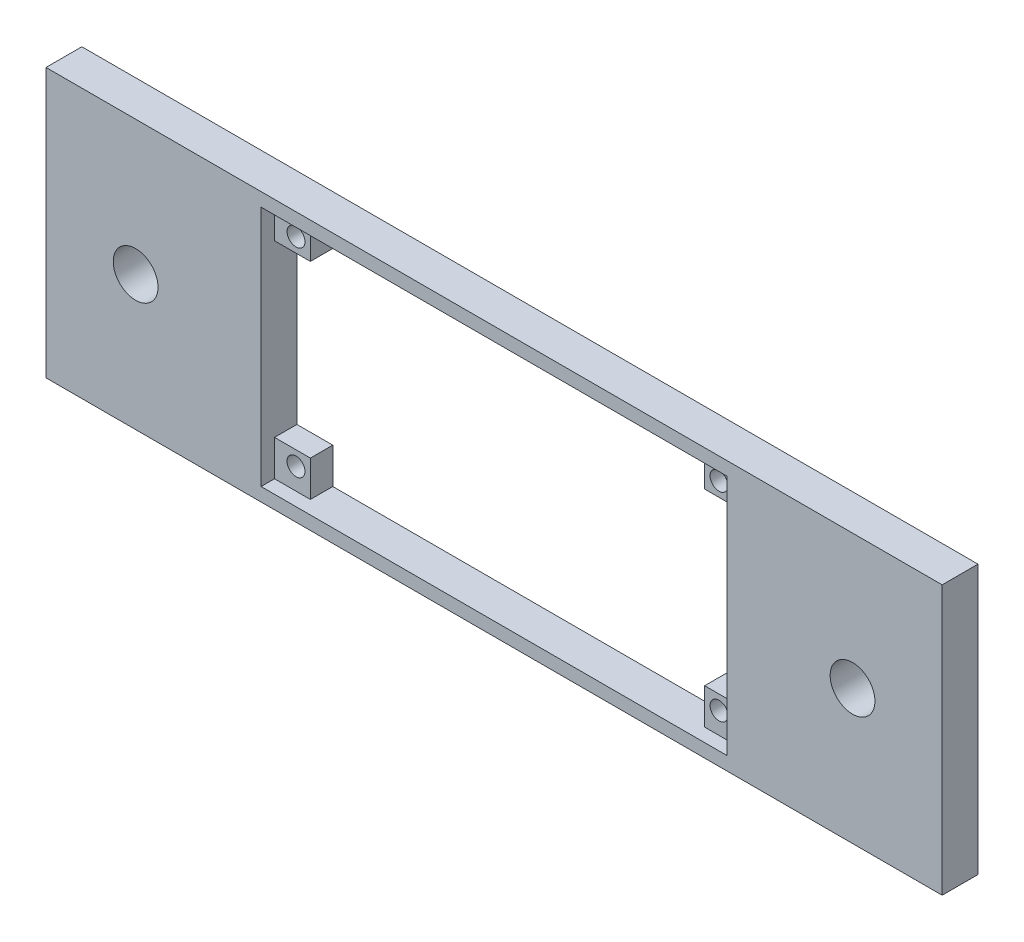
ISO-10303-21;
HEADER;
FILE_DESCRIPTION(('STEP AP214'),'2;1');
FILE_NAME('part.step','',(''),(''),'','','');
FILE_SCHEMA(('AUTOMOTIVE_DESIGN { 1 0 10303 214 1 1 1 1 }'));
ENDSEC;
DATA;
#1=APPLICATION_CONTEXT('core data for automotive mechanical design processes');
#2=APPLICATION_PROTOCOL_DEFINITION('international standard','automotive_design',2000,#1);
#3=PRODUCT_CONTEXT('',#1,'mechanical');
#4=PRODUCT('Part','Part','',(#3));
#5=PRODUCT_RELATED_PRODUCT_CATEGORY('part','',(#4));
#6=PRODUCT_DEFINITION_FORMATION('','',#4);
#7=PRODUCT_DEFINITION_CONTEXT('part definition',#1,'design');
#8=PRODUCT_DEFINITION('design','',#6,#7);
#9=PRODUCT_DEFINITION_SHAPE('','',#8);
#10=(LENGTH_UNIT() NAMED_UNIT(*) SI_UNIT(.MILLI.,.METRE.));
#11=(NAMED_UNIT(*) PLANE_ANGLE_UNIT() SI_UNIT($,.RADIAN.));
#12=(NAMED_UNIT(*) SI_UNIT($,.STERADIAN.) SOLID_ANGLE_UNIT());
#13=UNCERTAINTY_MEASURE_WITH_UNIT(LENGTH_MEASURE(1.E-05),#10,'distance_accuracy_value','');
#14=(GEOMETRIC_REPRESENTATION_CONTEXT(3) GLOBAL_UNCERTAINTY_ASSIGNED_CONTEXT((#13)) GLOBAL_UNIT_ASSIGNED_CONTEXT((#10,
#11,#12)) REPRESENTATION_CONTEXT('',''));
#15=CARTESIAN_POINT('',(0.,0.,0.));
#16=DIRECTION('',(0.,0.,1.));
#17=DIRECTION('',(1.,0.,0.));
#18=AXIS2_PLACEMENT_3D('',#15,#16,#17);
#19=CARTESIAN_POINT('',(-26.,13.5,4.));
#20=DIRECTION('',(0.,-1.,0.));
#21=DIRECTION('',(1.,0.,0.));
#22=AXIS2_PLACEMENT_3D('',#19,#20,#21);
#23=PLANE('',#22);
#24=DIRECTION('',(0.,0.,-1.));
#25=VECTOR('',#24,1.);
#26=CARTESIAN_POINT('',(-26.,13.5,4.));
#27=LINE('',#26,#25);
#28=CARTESIAN_POINT('',(-26.,13.5,4.));
#29=VERTEX_POINT('',#28);
#30=CARTESIAN_POINT('',(-26.,13.5,2.5));
#31=VERTEX_POINT('',#30);
#32=EDGE_CURVE('E190',#29,#31,#27,.T.);
#33=ORIENTED_EDGE('',*,*,#32,.T.);
#34=DIRECTION('',(-1.,0.,0.));
#35=VECTOR('',#34,1.);
#36=CARTESIAN_POINT('',(-26.,13.5,2.5));
#37=LINE('',#36,#35);
#38=CARTESIAN_POINT('',(-22.,13.5,2.5));
#39=VERTEX_POINT('',#38);
#40=EDGE_CURVE('E172',#39,#31,#37,.T.);
#41=ORIENTED_EDGE('',*,*,#40,.F.);
#42=DIRECTION('',(0.,0.,-1.));
#43=VECTOR('',#42,1.);
#44=CARTESIAN_POINT('',(-22.,13.5,2.5));
#45=LINE('',#44,#43);
#46=CARTESIAN_POINT('',(-22.,13.5,0.));
#47=VERTEX_POINT('',#46);
#48=EDGE_CURVE('E370',#39,#47,#45,.T.);
#49=ORIENTED_EDGE('',*,*,#48,.T.);
#50=DIRECTION('',(-1.,0.,0.));
#51=VECTOR('',#50,1.);
#52=CARTESIAN_POINT('',(-26.,13.5,0.));
#53=LINE('',#52,#51);
#54=CARTESIAN_POINT('',(22.,13.5,0.));
#55=VERTEX_POINT('',#54);
#56=EDGE_CURVE('E484',#55,#47,#53,.T.);
#57=ORIENTED_EDGE('',*,*,#56,.F.);
#58=DIRECTION('',(0.,0.,-1.));
#59=VECTOR('',#58,1.);
#60=CARTESIAN_POINT('',(22.,13.5,2.5));
#61=LINE('',#60,#59);
#62=CARTESIAN_POINT('',(22.,13.5,2.5));
#63=VERTEX_POINT('',#62);
#64=EDGE_CURVE('E460',#63,#55,#61,.T.);
#65=ORIENTED_EDGE('',*,*,#64,.F.);
#66=DIRECTION('',(-1.,0.,0.));
#67=VECTOR('',#66,1.);
#68=CARTESIAN_POINT('',(26.,13.5,2.5));
#69=LINE('',#68,#67);
#70=CARTESIAN_POINT('',(26.,13.5,2.5));
#71=VERTEX_POINT('',#70);
#72=EDGE_CURVE('E443',#71,#63,#69,.T.);
#73=ORIENTED_EDGE('',*,*,#72,.F.);
#74=DIRECTION('',(0.,0.,-1.));
#75=VECTOR('',#74,1.);
#76=CARTESIAN_POINT('',(26.,13.5,4.));
#77=LINE('',#76,#75);
#78=CARTESIAN_POINT('',(26.,13.5,4.));
#79=VERTEX_POINT('',#78);
#80=EDGE_CURVE('E198',#79,#71,#77,.T.);
#81=ORIENTED_EDGE('',*,*,#80,.F.);
#82=DIRECTION('',(-1.,0.,0.));
#83=VECTOR('',#82,1.);
#84=CARTESIAN_POINT('',(-26.,13.5,4.));
#85=LINE('',#84,#83);
#86=EDGE_CURVE('E197',#79,#29,#85,.T.);
#87=ORIENTED_EDGE('',*,*,#86,.T.);
#88=EDGE_LOOP('',(#33,#41,#49,#57,#65,#73,#81,#87));
#89=FACE_BOUND('',#88,.T.);
#90=ADVANCED_FACE('F36',(#89),#23,.T.);
#91=CARTESIAN_POINT('',(-26.,-13.5,4.));
#92=DIRECTION('',(1.,0.,0.));
#93=DIRECTION('',(0.,0.,-1.));
#94=AXIS2_PLACEMENT_3D('',#91,#92,#93);
#95=PLANE('',#94);
#96=DIRECTION('',(0.,0.,-1.));
#97=VECTOR('',#96,1.);
#98=CARTESIAN_POINT('',(-26.,9.5,2.5));
#99=LINE('',#98,#97);
#100=CARTESIAN_POINT('',(-26.,9.5,2.5));
#101=VERTEX_POINT('',#100);
#102=CARTESIAN_POINT('',(-26.,9.5,0.));
#103=VERTEX_POINT('',#102);
#104=EDGE_CURVE('E193',#101,#103,#99,.T.);
#105=ORIENTED_EDGE('',*,*,#104,.F.);
#106=DIRECTION('',(0.,-1.,0.));
#107=VECTOR('',#106,1.);
#108=CARTESIAN_POINT('',(-26.,13.5,2.5));
#109=LINE('',#108,#107);
#110=EDGE_CURVE('E176',#31,#101,#109,.T.);
#111=ORIENTED_EDGE('',*,*,#110,.F.);
#112=ORIENTED_EDGE('',*,*,#32,.F.);
#113=DIRECTION('',(0.,-1.,0.));
#114=VECTOR('',#113,1.);
#115=CARTESIAN_POINT('',(-26.,-13.5,4.));
#116=LINE('',#115,#114);
#117=CARTESIAN_POINT('',(-26.,-13.5,4.));
#118=VERTEX_POINT('',#117);
#119=EDGE_CURVE('E479',#29,#118,#116,.T.);
#120=ORIENTED_EDGE('',*,*,#119,.T.);
#121=DIRECTION('',(0.,0.,-1.));
#122=VECTOR('',#121,1.);
#123=CARTESIAN_POINT('',(-26.,-13.5,4.));
#124=LINE('',#123,#122);
#125=CARTESIAN_POINT('',(-26.,-13.5,2.5));
#126=VERTEX_POINT('',#125);
#127=EDGE_CURVE('E199',#118,#126,#124,.T.);
#128=ORIENTED_EDGE('',*,*,#127,.T.);
#129=DIRECTION('',(0.,-1.,0.));
#130=VECTOR('',#129,1.);
#131=CARTESIAN_POINT('',(-26.,-13.5,2.5));
#132=LINE('',#131,#130);
#133=CARTESIAN_POINT('',(-26.,-9.5,2.5));
#134=VERTEX_POINT('',#133);
#135=EDGE_CURVE('E391',#134,#126,#132,.T.);
#136=ORIENTED_EDGE('',*,*,#135,.F.);
#137=DIRECTION('',(0.,0.,-1.));
#138=VECTOR('',#137,1.);
#139=CARTESIAN_POINT('',(-26.,-9.5,2.5));
#140=LINE('',#139,#138);
#141=CARTESIAN_POINT('',(-26.,-9.5,0.));
#142=VERTEX_POINT('',#141);
#143=EDGE_CURVE('E393',#134,#142,#140,.T.);
#144=ORIENTED_EDGE('',*,*,#143,.T.);
#145=DIRECTION('',(0.,-1.,0.));
#146=VECTOR('',#145,1.);
#147=CARTESIAN_POINT('',(-26.,-13.5,0.));
#148=LINE('',#147,#146);
#149=EDGE_CURVE('E487',#103,#142,#148,.T.);
#150=ORIENTED_EDGE('',*,*,#149,.F.);
#151=EDGE_LOOP('',(#105,#111,#112,#120,#128,#136,#144,#150));
#152=FACE_BOUND('',#151,.T.);
#153=ADVANCED_FACE('F188',(#152),#95,.T.);
#154=CARTESIAN_POINT('',(26.,-13.5,4.));
#155=DIRECTION('',(-1.,0.,0.));
#156=DIRECTION('',(0.,-1.,0.));
#157=AXIS2_PLACEMENT_3D('',#154,#155,#156);
#158=PLANE('',#157);
#159=DIRECTION('',(0.,1.,0.));
#160=VECTOR('',#159,1.);
#161=CARTESIAN_POINT('',(26.,-13.5,2.5));
#162=LINE('',#161,#160);
#163=CARTESIAN_POINT('',(26.,-13.5,2.5));
#164=VERTEX_POINT('',#163);
#165=CARTESIAN_POINT('',(26.,-9.5,2.5));
#166=VERTEX_POINT('',#165);
#167=EDGE_CURVE('E412',#164,#166,#162,.T.);
#168=ORIENTED_EDGE('',*,*,#167,.F.);
#169=DIRECTION('',(0.,0.,-1.));
#170=VECTOR('',#169,1.);
#171=CARTESIAN_POINT('',(26.,-13.5,4.));
#172=LINE('',#171,#170);
#173=CARTESIAN_POINT('',(26.,-13.5,4.));
#174=VERTEX_POINT('',#173);
#175=EDGE_CURVE('E205',#174,#164,#172,.T.);
#176=ORIENTED_EDGE('',*,*,#175,.F.);
#177=DIRECTION('',(0.,1.,0.));
#178=VECTOR('',#177,1.);
#179=CARTESIAN_POINT('',(26.,-13.5,4.));
#180=LINE('',#179,#178);
#181=EDGE_CURVE('E475',#174,#79,#180,.T.);
#182=ORIENTED_EDGE('',*,*,#181,.T.);
#183=ORIENTED_EDGE('',*,*,#80,.T.);
#184=DIRECTION('',(0.,1.,0.));
#185=VECTOR('',#184,1.);
#186=CARTESIAN_POINT('',(26.,13.5,2.5));
#187=LINE('',#186,#185);
#188=CARTESIAN_POINT('',(26.,9.5,2.5));
#189=VERTEX_POINT('',#188);
#190=EDGE_CURVE('E441',#189,#71,#187,.T.);
#191=ORIENTED_EDGE('',*,*,#190,.F.);
#192=DIRECTION('',(0.,0.,-1.));
#193=VECTOR('',#192,1.);
#194=CARTESIAN_POINT('',(26.,9.5,2.5));
#195=LINE('',#194,#193);
#196=CARTESIAN_POINT('',(26.,9.5,0.));
#197=VERTEX_POINT('',#196);
#198=EDGE_CURVE('E451',#189,#197,#195,.T.);
#199=ORIENTED_EDGE('',*,*,#198,.T.);
#200=DIRECTION('',(0.,1.,0.));
#201=VECTOR('',#200,1.);
#202=CARTESIAN_POINT('',(26.,-13.5,0.));
#203=LINE('',#202,#201);
#204=CARTESIAN_POINT('',(26.,-9.5,0.));
#205=VERTEX_POINT('',#204);
#206=EDGE_CURVE('E472',#205,#197,#203,.T.);
#207=ORIENTED_EDGE('',*,*,#206,.F.);
#208=DIRECTION('',(0.,0.,-1.));
#209=VECTOR('',#208,1.);
#210=CARTESIAN_POINT('',(26.,-9.5,2.5));
#211=LINE('',#210,#209);
#212=EDGE_CURVE('E431',#166,#205,#211,.T.);
#213=ORIENTED_EDGE('',*,*,#212,.F.);
#214=EDGE_LOOP('',(#168,#176,#182,#183,#191,#199,#207,#213));
#215=FACE_BOUND('',#214,.T.);
#216=ADVANCED_FACE('F266',(#215),#158,.T.);
#217=CARTESIAN_POINT('',(0.,0.,4.));
#218=DIRECTION('',(0.,0.,-1.));
#219=DIRECTION('',(-1.,0.,0.));
#220=AXIS2_PLACEMENT_3D('',#217,#218,#219);
#221=PLANE('',#220);
#222=DIRECTION('',(0.,1.,0.));
#223=VECTOR('',#222,1.);
#224=CARTESIAN_POINT('',(50.,-15.,4.));
#225=LINE('',#224,#223);
#226=CARTESIAN_POINT('',(50.,-15.,4.));
#227=VERTEX_POINT('',#226);
#228=CARTESIAN_POINT('',(50.,15.,4.));
#229=VERTEX_POINT('',#228);
#230=EDGE_CURVE('E209',#227,#229,#225,.T.);
#231=ORIENTED_EDGE('',*,*,#230,.T.);
#232=DIRECTION('',(-1.,0.,0.));
#233=VECTOR('',#232,1.);
#234=CARTESIAN_POINT('',(-50.,15.,4.));
#235=LINE('',#234,#233);
#236=CARTESIAN_POINT('',(-50.,15.,4.));
#237=VERTEX_POINT('',#236);
#238=EDGE_CURVE('E212',#229,#237,#235,.T.);
#239=ORIENTED_EDGE('',*,*,#238,.T.);
#240=DIRECTION('',(0.,-1.,0.));
#241=VECTOR('',#240,1.);
#242=CARTESIAN_POINT('',(-50.,-15.,4.));
#243=LINE('',#242,#241);
#244=CARTESIAN_POINT('',(-50.,-15.,4.));
#245=VERTEX_POINT('',#244);
#246=EDGE_CURVE('E215',#237,#245,#243,.T.);
#247=ORIENTED_EDGE('',*,*,#246,.T.);
#248=DIRECTION('',(1.,0.,0.));
#249=VECTOR('',#248,1.);
#250=CARTESIAN_POINT('',(-50.,-15.,4.));
#251=LINE('',#250,#249);
#252=EDGE_CURVE('E217',#245,#227,#251,.T.);
#253=ORIENTED_EDGE('',*,*,#252,.T.);
#254=EDGE_LOOP('',(#231,#239,#247,#253));
#255=FACE_BOUND('',#254,.T.);
#256=ORIENTED_EDGE('',*,*,#181,.F.);
#257=DIRECTION('',(1.,0.,0.));
#258=VECTOR('',#257,1.);
#259=CARTESIAN_POINT('',(-26.,-13.5,4.));
#260=LINE('',#259,#258);
#261=EDGE_CURVE('E481',#118,#174,#260,.T.);
#262=ORIENTED_EDGE('',*,*,#261,.F.);
#263=ORIENTED_EDGE('',*,*,#119,.F.);
#264=ORIENTED_EDGE('',*,*,#86,.F.);
#265=EDGE_LOOP('',(#256,#262,#263,#264));
#266=FACE_BOUND('',#265,.T.);
#267=CARTESIAN_POINT('',(-40.,0.,4.));
#268=DIRECTION('',(0.,0.,1.));
#269=DIRECTION('',(1.,0.,0.));
#270=AXIS2_PLACEMENT_3D('',#267,#268,#269);
#271=CIRCLE('',#270,2.5);
#272=CARTESIAN_POINT('',(-37.5,0.,4.));
#273=VERTEX_POINT('',#272);
#274=EDGE_CURVE('E469',#273,#273,#271,.T.);
#275=ORIENTED_EDGE('',*,*,#274,.F.);
#276=EDGE_LOOP('',(#275));
#277=FACE_BOUND('',#276,.T.);
#278=CARTESIAN_POINT('',(40.,0.,4.));
#279=DIRECTION('',(0.,0.,1.));
#280=DIRECTION('',(-1.,0.,0.));
#281=AXIS2_PLACEMENT_3D('',#278,#279,#280);
#282=CIRCLE('',#281,2.5);
#283=CARTESIAN_POINT('',(37.5,0.,4.));
#284=VERTEX_POINT('',#283);
#285=EDGE_CURVE('E463',#284,#284,#282,.T.);
#286=ORIENTED_EDGE('',*,*,#285,.F.);
#287=EDGE_LOOP('',(#286));
#288=FACE_BOUND('',#287,.T.);
#289=ADVANCED_FACE('F252',(#255,#266,#277,#288),#221,.F.);
#290=CARTESIAN_POINT('',(0.,0.,0.));
#291=DIRECTION('',(0.,0.,-1.));
#292=DIRECTION('',(-1.,0.,0.));
#293=AXIS2_PLACEMENT_3D('',#290,#291,#292);
#294=PLANE('',#293);
#295=DIRECTION('',(-1.,0.,0.));
#296=VECTOR('',#295,1.);
#297=CARTESIAN_POINT('',(26.,-9.5,0.));
#298=LINE('',#297,#296);
#299=CARTESIAN_POINT('',(22.,-9.5,0.));
#300=VERTEX_POINT('',#299);
#301=EDGE_CURVE('E409',#205,#300,#298,.T.);
#302=ORIENTED_EDGE('',*,*,#301,.F.);
#303=ORIENTED_EDGE('',*,*,#206,.T.);
#304=DIRECTION('',(1.,0.,0.));
#305=VECTOR('',#304,1.);
#306=CARTESIAN_POINT('',(26.,9.5,0.));
#307=LINE('',#306,#305);
#308=CARTESIAN_POINT('',(22.,9.5,0.));
#309=VERTEX_POINT('',#308);
#310=EDGE_CURVE('E444',#309,#197,#307,.T.);
#311=ORIENTED_EDGE('',*,*,#310,.F.);
#312=DIRECTION('',(0.,-1.,0.));
#313=VECTOR('',#312,1.);
#314=CARTESIAN_POINT('',(22.,13.5,0.));
#315=LINE('',#314,#313);
#316=EDGE_CURVE('E438',#55,#309,#315,.T.);
#317=ORIENTED_EDGE('',*,*,#316,.F.);
#318=ORIENTED_EDGE('',*,*,#56,.T.);
#319=DIRECTION('',(0.,1.,0.));
#320=VECTOR('',#319,1.);
#321=CARTESIAN_POINT('',(-22.,13.5,0.));
#322=LINE('',#321,#320);
#323=CARTESIAN_POINT('',(-22.,9.50000000000001,0.));
#324=VERTEX_POINT('',#323);
#325=EDGE_CURVE('E184',#324,#47,#322,.T.);
#326=ORIENTED_EDGE('',*,*,#325,.F.);
#327=DIRECTION('',(1.,0.,0.));
#328=VECTOR('',#327,1.);
#329=CARTESIAN_POINT('',(-26.,9.5,0.));
#330=LINE('',#329,#328);
#331=EDGE_CURVE('E365',#103,#324,#330,.T.);
#332=ORIENTED_EDGE('',*,*,#331,.F.);
#333=ORIENTED_EDGE('',*,*,#149,.T.);
#334=DIRECTION('',(-1.,0.,0.));
#335=VECTOR('',#334,1.);
#336=CARTESIAN_POINT('',(-26.,-9.5,0.));
#337=LINE('',#336,#335);
#338=CARTESIAN_POINT('',(-22.,-9.50000000000001,0.));
#339=VERTEX_POINT('',#338);
#340=EDGE_CURVE('E387',#339,#142,#337,.T.);
#341=ORIENTED_EDGE('',*,*,#340,.F.);
#342=DIRECTION('',(0.,1.,0.));
#343=VECTOR('',#342,1.);
#344=CARTESIAN_POINT('',(-22.,-13.5,0.));
#345=LINE('',#344,#343);
#346=CARTESIAN_POINT('',(-22.,-13.5,0.));
#347=VERTEX_POINT('',#346);
#348=EDGE_CURVE('E382',#347,#339,#345,.T.);
#349=ORIENTED_EDGE('',*,*,#348,.F.);
#350=DIRECTION('',(1.,0.,0.));
#351=VECTOR('',#350,1.);
#352=CARTESIAN_POINT('',(-26.,-13.5,0.));
#353=LINE('',#352,#351);
#354=CARTESIAN_POINT('',(22.,-13.5,0.));
#355=VERTEX_POINT('',#354);
#356=EDGE_CURVE('E477',#347,#355,#353,.T.);
#357=ORIENTED_EDGE('',*,*,#356,.T.);
#358=DIRECTION('',(0.,-1.,0.));
#359=VECTOR('',#358,1.);
#360=CARTESIAN_POINT('',(22.,-13.5,0.));
#361=LINE('',#360,#359);
#362=EDGE_CURVE('E416',#300,#355,#361,.T.);
#363=ORIENTED_EDGE('',*,*,#362,.F.);
#364=EDGE_LOOP('',(#302,#303,#311,#317,#318,#326,#332,#333,#341,#349,#357,#363));
#365=FACE_BOUND('',#364,.T.);
#366=CARTESIAN_POINT('',(-40.,0.,0.));
#367=DIRECTION('',(0.,0.,1.));
#368=DIRECTION('',(1.,0.,0.));
#369=AXIS2_PLACEMENT_3D('',#366,#367,#368);
#370=CIRCLE('',#369,2.5);
#371=CARTESIAN_POINT('',(-37.5,0.,0.));
#372=VERTEX_POINT('',#371);
#373=EDGE_CURVE('E466',#372,#372,#370,.T.);
#374=ORIENTED_EDGE('',*,*,#373,.T.);
#375=EDGE_LOOP('',(#374));
#376=FACE_BOUND('',#375,.T.);
#377=DIRECTION('',(0.,1.,0.));
#378=VECTOR('',#377,1.);
#379=CARTESIAN_POINT('',(50.,-15.,0.));
#380=LINE('',#379,#378);
#381=CARTESIAN_POINT('',(50.,-15.,0.));
#382=VERTEX_POINT('',#381);
#383=CARTESIAN_POINT('',(50.,15.,0.));
#384=VERTEX_POINT('',#383);
#385=EDGE_CURVE('E202',#382,#384,#380,.T.);
#386=ORIENTED_EDGE('',*,*,#385,.F.);
#387=DIRECTION('',(1.,0.,0.));
#388=VECTOR('',#387,1.);
#389=CARTESIAN_POINT('',(-50.,-15.,0.));
#390=LINE('',#389,#388);
#391=CARTESIAN_POINT('',(-50.,-15.,0.));
#392=VERTEX_POINT('',#391);
#393=EDGE_CURVE('E213',#392,#382,#390,.T.);
#394=ORIENTED_EDGE('',*,*,#393,.F.);
#395=DIRECTION('',(0.,-1.,0.));
#396=VECTOR('',#395,1.);
#397=CARTESIAN_POINT('',(-50.,-15.,0.));
#398=LINE('',#397,#396);
#399=CARTESIAN_POINT('',(-50.,15.,0.));
#400=VERTEX_POINT('',#399);
#401=EDGE_CURVE('E224',#400,#392,#398,.T.);
#402=ORIENTED_EDGE('',*,*,#401,.F.);
#403=DIRECTION('',(-1.,0.,0.));
#404=VECTOR('',#403,1.);
#405=CARTESIAN_POINT('',(-50.,15.,0.));
#406=LINE('',#405,#404);
#407=EDGE_CURVE('E222',#384,#400,#406,.T.);
#408=ORIENTED_EDGE('',*,*,#407,.F.);
#409=EDGE_LOOP('',(#386,#394,#402,#408));
#410=FACE_BOUND('',#409,.T.);
#411=CARTESIAN_POINT('',(40.,0.,0.));
#412=DIRECTION('',(0.,0.,1.));
#413=DIRECTION('',(-1.,0.,0.));
#414=AXIS2_PLACEMENT_3D('',#411,#412,#413);
#415=CIRCLE('',#414,2.5);
#416=CARTESIAN_POINT('',(37.5,0.,0.));
#417=VERTEX_POINT('',#416);
#418=EDGE_CURVE('E462',#417,#417,#415,.T.);
#419=ORIENTED_EDGE('',*,*,#418,.T.);
#420=EDGE_LOOP('',(#419));
#421=FACE_BOUND('',#420,.T.);
#422=CARTESIAN_POINT('',(23.6,11.1,0.));
#423=DIRECTION('',(0.,0.,1.));
#424=DIRECTION('',(1.,0.,0.));
#425=AXIS2_PLACEMENT_3D('',#422,#423,#424);
#426=CIRCLE('',#425,1.);
#427=CARTESIAN_POINT('',(24.6,11.1,0.));
#428=VERTEX_POINT('',#427);
#429=EDGE_CURVE('E434',#428,#428,#426,.T.);
#430=ORIENTED_EDGE('',*,*,#429,.T.);
#431=EDGE_LOOP('',(#430));
#432=FACE_BOUND('',#431,.T.);
#433=CARTESIAN_POINT('',(23.6,-11.1,0.));
#434=DIRECTION('',(0.,0.,1.));
#435=DIRECTION('',(-1.,0.,0.));
#436=AXIS2_PLACEMENT_3D('',#433,#434,#435);
#437=CIRCLE('',#436,1.);
#438=CARTESIAN_POINT('',(22.6,-11.1,0.));
#439=VERTEX_POINT('',#438);
#440=EDGE_CURVE('E405',#439,#439,#437,.T.);
#441=ORIENTED_EDGE('',*,*,#440,.T.);
#442=EDGE_LOOP('',(#441));
#443=FACE_BOUND('',#442,.T.);
#444=CARTESIAN_POINT('',(-23.6,-11.1,0.));
#445=DIRECTION('',(0.,0.,1.));
#446=DIRECTION('',(1.,0.,0.));
#447=AXIS2_PLACEMENT_3D('',#444,#445,#446);
#448=CIRCLE('',#447,1.);
#449=CARTESIAN_POINT('',(-22.6,-11.1,0.));
#450=VERTEX_POINT('',#449);
#451=EDGE_CURVE('E378',#450,#450,#448,.T.);
#452=ORIENTED_EDGE('',*,*,#451,.T.);
#453=EDGE_LOOP('',(#452));
#454=FACE_BOUND('',#453,.T.);
#455=CARTESIAN_POINT('',(-23.6,11.1,0.));
#456=DIRECTION('',(0.,0.,1.));
#457=DIRECTION('',(-1.,0.,0.));
#458=AXIS2_PLACEMENT_3D('',#455,#456,#457);
#459=CIRCLE('',#458,1.);
#460=CARTESIAN_POINT('',(-24.6,11.1,0.));
#461=VERTEX_POINT('',#460);
#462=EDGE_CURVE('E362',#461,#461,#459,.T.);
#463=ORIENTED_EDGE('',*,*,#462,.T.);
#464=EDGE_LOOP('',(#463));
#465=FACE_BOUND('',#464,.T.);
#466=ADVANCED_FACE('F242',(#365,#376,#410,#421,#432,#443,#454,#465),#294,.T.);
#467=CARTESIAN_POINT('',(50.,-15.,4.));
#468=DIRECTION('',(-1.,0.,0.));
#469=DIRECTION('',(0.,0.,1.));
#470=AXIS2_PLACEMENT_3D('',#467,#468,#469);
#471=PLANE('',#470);
#472=ORIENTED_EDGE('',*,*,#385,.T.);
#473=DIRECTION('',(0.,0.,-1.));
#474=VECTOR('',#473,1.);
#475=CARTESIAN_POINT('',(50.,15.,4.));
#476=LINE('',#475,#474);
#477=EDGE_CURVE('E11',#229,#384,#476,.T.);
#478=ORIENTED_EDGE('',*,*,#477,.F.);
#479=ORIENTED_EDGE('',*,*,#230,.F.);
#480=DIRECTION('',(0.,0.,-1.));
#481=VECTOR('',#480,1.);
#482=CARTESIAN_POINT('',(50.,-15.,4.));
#483=LINE('',#482,#481);
#484=EDGE_CURVE('E219',#227,#382,#483,.T.);
#485=ORIENTED_EDGE('',*,*,#484,.T.);
#486=EDGE_LOOP('',(#472,#478,#479,#485));
#487=FACE_BOUND('',#486,.T.);
#488=ADVANCED_FACE('F38',(#487),#471,.F.);
#489=CARTESIAN_POINT('',(-50.,15.,4.));
#490=DIRECTION('',(0.,-1.,0.));
#491=DIRECTION('',(0.,0.,-1.));
#492=AXIS2_PLACEMENT_3D('',#489,#490,#491);
#493=PLANE('',#492);
#494=ORIENTED_EDGE('',*,*,#407,.T.);
#495=DIRECTION('',(0.,0.,-1.));
#496=VECTOR('',#495,1.);
#497=CARTESIAN_POINT('',(-50.,15.,4.));
#498=LINE('',#497,#496);
#499=EDGE_CURVE('E44',#237,#400,#498,.T.);
#500=ORIENTED_EDGE('',*,*,#499,.F.);
#501=ORIENTED_EDGE('',*,*,#238,.F.);
#502=ORIENTED_EDGE('',*,*,#477,.T.);
#503=EDGE_LOOP('',(#494,#500,#501,#502));
#504=FACE_BOUND('',#503,.T.);
#505=ADVANCED_FACE('F254',(#504),#493,.F.);
#506=CARTESIAN_POINT('',(-50.,-15.,4.));
#507=DIRECTION('',(1.,0.,0.));
#508=DIRECTION('',(0.,0.,-1.));
#509=AXIS2_PLACEMENT_3D('',#506,#507,#508);
#510=PLANE('',#509);
#511=ORIENTED_EDGE('',*,*,#401,.T.);
#512=DIRECTION('',(0.,0.,-1.));
#513=VECTOR('',#512,1.);
#514=CARTESIAN_POINT('',(-50.,-15.,4.));
#515=LINE('',#514,#513);
#516=EDGE_CURVE('E229',#245,#392,#515,.T.);
#517=ORIENTED_EDGE('',*,*,#516,.F.);
#518=ORIENTED_EDGE('',*,*,#246,.F.);
#519=ORIENTED_EDGE('',*,*,#499,.T.);
#520=EDGE_LOOP('',(#511,#517,#518,#519));
#521=FACE_BOUND('',#520,.T.);
#522=ADVANCED_FACE('F236',(#521),#510,.F.);
#523=CARTESIAN_POINT('',(-50.,-15.,4.));
#524=DIRECTION('',(0.,1.,0.));
#525=DIRECTION('',(0.,0.,1.));
#526=AXIS2_PLACEMENT_3D('',#523,#524,#525);
#527=PLANE('',#526);
#528=ORIENTED_EDGE('',*,*,#393,.T.);
#529=ORIENTED_EDGE('',*,*,#484,.F.);
#530=ORIENTED_EDGE('',*,*,#252,.F.);
#531=ORIENTED_EDGE('',*,*,#516,.T.);
#532=EDGE_LOOP('',(#528,#529,#530,#531));
#533=FACE_BOUND('',#532,.T.);
#534=ADVANCED_FACE('F246',(#533),#527,.F.);
#535=CARTESIAN_POINT('',(-26.,-13.5,4.));
#536=DIRECTION('',(0.,1.,0.));
#537=DIRECTION('',(-1.,0.,0.));
#538=AXIS2_PLACEMENT_3D('',#535,#536,#537);
#539=PLANE('',#538);
#540=DIRECTION('',(1.,0.,0.));
#541=VECTOR('',#540,1.);
#542=CARTESIAN_POINT('',(-26.,-13.5,2.5));
#543=LINE('',#542,#541);
#544=CARTESIAN_POINT('',(-22.,-13.5,2.5));
#545=VERTEX_POINT('',#544);
#546=EDGE_CURVE('E59',#126,#545,#543,.T.);
#547=ORIENTED_EDGE('',*,*,#546,.F.);
#548=ORIENTED_EDGE('',*,*,#127,.F.);
#549=ORIENTED_EDGE('',*,*,#261,.T.);
#550=ORIENTED_EDGE('',*,*,#175,.T.);
#551=DIRECTION('',(1.,0.,0.));
#552=VECTOR('',#551,1.);
#553=CARTESIAN_POINT('',(26.,-13.5,2.5));
#554=LINE('',#553,#552);
#555=CARTESIAN_POINT('',(22.,-13.5,2.5));
#556=VERTEX_POINT('',#555);
#557=EDGE_CURVE('E420',#556,#164,#554,.T.);
#558=ORIENTED_EDGE('',*,*,#557,.F.);
#559=DIRECTION('',(0.,0.,-1.));
#560=VECTOR('',#559,1.);
#561=CARTESIAN_POINT('',(22.,-13.5,2.5));
#562=LINE('',#561,#560);
#563=EDGE_CURVE('E422',#556,#355,#562,.T.);
#564=ORIENTED_EDGE('',*,*,#563,.T.);
#565=ORIENTED_EDGE('',*,*,#356,.F.);
#566=DIRECTION('',(0.,0.,-1.));
#567=VECTOR('',#566,1.);
#568=CARTESIAN_POINT('',(-22.,-13.5,2.5));
#569=LINE('',#568,#567);
#570=EDGE_CURVE('E402',#545,#347,#569,.T.);
#571=ORIENTED_EDGE('',*,*,#570,.F.);
#572=EDGE_LOOP('',(#547,#548,#549,#550,#558,#564,#565,#571));
#573=FACE_BOUND('',#572,.T.);
#574=ADVANCED_FACE('F279',(#573),#539,.T.);
#575=CARTESIAN_POINT('',(-40.,0.,4.));
#576=DIRECTION('',(0.,0.,-1.));
#577=DIRECTION('',(-1.,0.,0.));
#578=AXIS2_PLACEMENT_3D('',#575,#576,#577);
#579=CYLINDRICAL_SURFACE('',#578,2.5);
#580=ORIENTED_EDGE('',*,*,#274,.T.);
#581=EDGE_LOOP('',(#580));
#582=FACE_BOUND('',#581,.T.);
#583=ORIENTED_EDGE('',*,*,#373,.F.);
#584=EDGE_LOOP('',(#583));
#585=FACE_BOUND('',#584,.T.);
#586=ADVANCED_FACE('F283',(#582,#585),#579,.F.);
#587=CARTESIAN_POINT('',(40.,0.,4.));
#588=DIRECTION('',(0.,0.,-1.));
#589=DIRECTION('',(-1.,0.,0.));
#590=AXIS2_PLACEMENT_3D('',#587,#588,#589);
#591=CYLINDRICAL_SURFACE('',#590,2.5);
#592=ORIENTED_EDGE('',*,*,#285,.T.);
#593=EDGE_LOOP('',(#592));
#594=FACE_BOUND('',#593,.T.);
#595=ORIENTED_EDGE('',*,*,#418,.F.);
#596=EDGE_LOOP('',(#595));
#597=FACE_BOUND('',#596,.T.);
#598=ADVANCED_FACE('F288',(#594,#597),#591,.F.);
#599=CARTESIAN_POINT('',(0.,0.,2.5));
#600=DIRECTION('',(0.,0.,-1.));
#601=DIRECTION('',(-1.,0.,0.));
#602=AXIS2_PLACEMENT_3D('',#599,#600,#601);
#603=PLANE('',#602);
#604=ORIENTED_EDGE('',*,*,#190,.T.);
#605=ORIENTED_EDGE('',*,*,#72,.T.);
#606=DIRECTION('',(0.,-1.,0.));
#607=VECTOR('',#606,1.);
#608=CARTESIAN_POINT('',(22.,13.5,2.5));
#609=LINE('',#608,#607);
#610=CARTESIAN_POINT('',(22.,9.5,2.5));
#611=VERTEX_POINT('',#610);
#612=EDGE_CURVE('E447',#63,#611,#609,.T.);
#613=ORIENTED_EDGE('',*,*,#612,.T.);
#614=DIRECTION('',(1.,0.,0.));
#615=VECTOR('',#614,1.);
#616=CARTESIAN_POINT('',(26.,9.5,2.5));
#617=LINE('',#616,#615);
#618=EDGE_CURVE('E449',#611,#189,#617,.T.);
#619=ORIENTED_EDGE('',*,*,#618,.T.);
#620=EDGE_LOOP('',(#604,#605,#613,#619));
#621=FACE_BOUND('',#620,.T.);
#622=CARTESIAN_POINT('',(23.6,11.1,2.5));
#623=DIRECTION('',(0.,0.,1.));
#624=DIRECTION('',(1.,0.,0.));
#625=AXIS2_PLACEMENT_3D('',#622,#623,#624);
#626=CIRCLE('',#625,1.);
#627=CARTESIAN_POINT('',(24.6,11.1,2.5));
#628=VERTEX_POINT('',#627);
#629=EDGE_CURVE('E435',#628,#628,#626,.T.);
#630=ORIENTED_EDGE('',*,*,#629,.F.);
#631=EDGE_LOOP('',(#630));
#632=FACE_BOUND('',#631,.T.);
#633=ADVANCED_FACE('F294',(#621,#632),#603,.F.);
#634=CARTESIAN_POINT('',(22.,13.5,2.5));
#635=DIRECTION('',(1.,0.,0.));
#636=DIRECTION('',(0.,1.,0.));
#637=AXIS2_PLACEMENT_3D('',#634,#635,#636);
#638=PLANE('',#637);
#639=ORIENTED_EDGE('',*,*,#316,.T.);
#640=DIRECTION('',(0.,0.,-1.));
#641=VECTOR('',#640,1.);
#642=CARTESIAN_POINT('',(22.,9.5,2.5));
#643=LINE('',#642,#641);
#644=EDGE_CURVE('E457',#611,#309,#643,.T.);
#645=ORIENTED_EDGE('',*,*,#644,.F.);
#646=ORIENTED_EDGE('',*,*,#612,.F.);
#647=ORIENTED_EDGE('',*,*,#64,.T.);
#648=EDGE_LOOP('',(#639,#645,#646,#647));
#649=FACE_BOUND('',#648,.T.);
#650=ADVANCED_FACE('F296',(#649),#638,.F.);
#651=CARTESIAN_POINT('',(26.,9.5,2.5));
#652=DIRECTION('',(0.,1.,0.));
#653=DIRECTION('',(-1.,0.,0.));
#654=AXIS2_PLACEMENT_3D('',#651,#652,#653);
#655=PLANE('',#654);
#656=ORIENTED_EDGE('',*,*,#310,.T.);
#657=ORIENTED_EDGE('',*,*,#198,.F.);
#658=ORIENTED_EDGE('',*,*,#618,.F.);
#659=ORIENTED_EDGE('',*,*,#644,.T.);
#660=EDGE_LOOP('',(#656,#657,#658,#659));
#661=FACE_BOUND('',#660,.T.);
#662=ADVANCED_FACE('F299',(#661),#655,.F.);
#663=CARTESIAN_POINT('',(23.6,11.1,2.5));
#664=DIRECTION('',(0.,0.,-1.));
#665=DIRECTION('',(-1.,0.,0.));
#666=AXIS2_PLACEMENT_3D('',#663,#664,#665);
#667=CYLINDRICAL_SURFACE('',#666,1.);
#668=ORIENTED_EDGE('',*,*,#629,.T.);
#669=EDGE_LOOP('',(#668));
#670=FACE_BOUND('',#669,.T.);
#671=ORIENTED_EDGE('',*,*,#429,.F.);
#672=EDGE_LOOP('',(#671));
#673=FACE_BOUND('',#672,.T.);
#674=ADVANCED_FACE('F303',(#670,#673),#667,.F.);
#675=CARTESIAN_POINT('',(0.,0.,2.5));
#676=DIRECTION('',(0.,0.,1.));
#677=DIRECTION('',(1.,0.,0.));
#678=AXIS2_PLACEMENT_3D('',#675,#676,#677);
#679=PLANE('',#678);
#680=ORIENTED_EDGE('',*,*,#167,.T.);
#681=DIRECTION('',(-1.,0.,0.));
#682=VECTOR('',#681,1.);
#683=CARTESIAN_POINT('',(26.,-9.5,2.5));
#684=LINE('',#683,#682);
#685=CARTESIAN_POINT('',(22.,-9.5,2.5));
#686=VERTEX_POINT('',#685);
#687=EDGE_CURVE('E415',#166,#686,#684,.T.);
#688=ORIENTED_EDGE('',*,*,#687,.T.);
#689=DIRECTION('',(0.,-1.,0.));
#690=VECTOR('',#689,1.);
#691=CARTESIAN_POINT('',(22.,-13.5,2.5));
#692=LINE('',#691,#690);
#693=EDGE_CURVE('E418',#686,#556,#692,.T.);
#694=ORIENTED_EDGE('',*,*,#693,.T.);
#695=ORIENTED_EDGE('',*,*,#557,.T.);
#696=EDGE_LOOP('',(#680,#688,#694,#695));
#697=FACE_BOUND('',#696,.T.);
#698=CARTESIAN_POINT('',(23.6,-11.1,2.5));
#699=DIRECTION('',(0.,0.,1.));
#700=DIRECTION('',(-1.,0.,0.));
#701=AXIS2_PLACEMENT_3D('',#698,#699,#700);
#702=CIRCLE('',#701,1.);
#703=CARTESIAN_POINT('',(22.6,-11.1,2.5));
#704=VERTEX_POINT('',#703);
#705=EDGE_CURVE('E406',#704,#704,#702,.T.);
#706=ORIENTED_EDGE('',*,*,#705,.F.);
#707=EDGE_LOOP('',(#706));
#708=FACE_BOUND('',#707,.T.);
#709=ADVANCED_FACE('F310',(#697,#708),#679,.T.);
#710=CARTESIAN_POINT('',(26.,-9.5,2.5));
#711=DIRECTION('',(0.,-1.,0.));
#712=DIRECTION('',(1.,0.,0.));
#713=AXIS2_PLACEMENT_3D('',#710,#711,#712);
#714=PLANE('',#713);
#715=ORIENTED_EDGE('',*,*,#301,.T.);
#716=DIRECTION('',(0.,0.,-1.));
#717=VECTOR('',#716,1.);
#718=CARTESIAN_POINT('',(22.,-9.5,2.5));
#719=LINE('',#718,#717);
#720=EDGE_CURVE('E428',#686,#300,#719,.T.);
#721=ORIENTED_EDGE('',*,*,#720,.F.);
#722=ORIENTED_EDGE('',*,*,#687,.F.);
#723=ORIENTED_EDGE('',*,*,#212,.T.);
#724=EDGE_LOOP('',(#715,#721,#722,#723));
#725=FACE_BOUND('',#724,.T.);
#726=ADVANCED_FACE('F312',(#725),#714,.F.);
#727=CARTESIAN_POINT('',(22.,-13.5,2.5));
#728=DIRECTION('',(1.,0.,0.));
#729=DIRECTION('',(0.,1.,0.));
#730=AXIS2_PLACEMENT_3D('',#727,#728,#729);
#731=PLANE('',#730);
#732=ORIENTED_EDGE('',*,*,#362,.T.);
#733=ORIENTED_EDGE('',*,*,#563,.F.);
#734=ORIENTED_EDGE('',*,*,#693,.F.);
#735=ORIENTED_EDGE('',*,*,#720,.T.);
#736=EDGE_LOOP('',(#732,#733,#734,#735));
#737=FACE_BOUND('',#736,.T.);
#738=ADVANCED_FACE('F315',(#737),#731,.F.);
#739=CARTESIAN_POINT('',(23.6,-11.1,2.5));
#740=DIRECTION('',(0.,0.,-1.));
#741=DIRECTION('',(-1.,0.,0.));
#742=AXIS2_PLACEMENT_3D('',#739,#740,#741);
#743=CYLINDRICAL_SURFACE('',#742,1.);
#744=ORIENTED_EDGE('',*,*,#705,.T.);
#745=EDGE_LOOP('',(#744));
#746=FACE_BOUND('',#745,.T.);
#747=ORIENTED_EDGE('',*,*,#440,.F.);
#748=EDGE_LOOP('',(#747));
#749=FACE_BOUND('',#748,.T.);
#750=ADVANCED_FACE('F319',(#746,#749),#743,.F.);
#751=CARTESIAN_POINT('',(0.,0.,2.5));
#752=DIRECTION('',(0.,0.,1.));
#753=DIRECTION('',(1.,0.,0.));
#754=AXIS2_PLACEMENT_3D('',#751,#752,#753);
#755=PLANE('',#754);
#756=ORIENTED_EDGE('',*,*,#546,.T.);
#757=DIRECTION('',(0.,1.,0.));
#758=VECTOR('',#757,1.);
#759=CARTESIAN_POINT('',(-22.,-13.5,2.5));
#760=LINE('',#759,#758);
#761=CARTESIAN_POINT('',(-22.,-9.50000000000001,2.5));
#762=VERTEX_POINT('',#761);
#763=EDGE_CURVE('E386',#545,#762,#760,.T.);
#764=ORIENTED_EDGE('',*,*,#763,.T.);
#765=DIRECTION('',(-1.,0.,0.));
#766=VECTOR('',#765,1.);
#767=CARTESIAN_POINT('',(-26.,-9.5,2.5));
#768=LINE('',#767,#766);
#769=EDGE_CURVE('E389',#762,#134,#768,.T.);
#770=ORIENTED_EDGE('',*,*,#769,.T.);
#771=ORIENTED_EDGE('',*,*,#135,.T.);
#772=EDGE_LOOP('',(#756,#764,#770,#771));
#773=FACE_BOUND('',#772,.T.);
#774=CARTESIAN_POINT('',(-23.6,-11.1,2.5));
#775=DIRECTION('',(0.,0.,1.));
#776=DIRECTION('',(1.,0.,0.));
#777=AXIS2_PLACEMENT_3D('',#774,#775,#776);
#778=CIRCLE('',#777,1.);
#779=CARTESIAN_POINT('',(-22.6,-11.1,2.5));
#780=VERTEX_POINT('',#779);
#781=EDGE_CURVE('E379',#780,#780,#778,.T.);
#782=ORIENTED_EDGE('',*,*,#781,.F.);
#783=EDGE_LOOP('',(#782));
#784=FACE_BOUND('',#783,.T.);
#785=ADVANCED_FACE('F326',(#773,#784),#755,.T.);
#786=CARTESIAN_POINT('',(-22.,-13.5,2.5));
#787=DIRECTION('',(-1.,0.,0.));
#788=DIRECTION('',(0.,-1.,0.));
#789=AXIS2_PLACEMENT_3D('',#786,#787,#788);
#790=PLANE('',#789);
#791=ORIENTED_EDGE('',*,*,#348,.T.);
#792=DIRECTION('',(0.,0.,-1.));
#793=VECTOR('',#792,1.);
#794=CARTESIAN_POINT('',(-22.,-9.50000000000001,2.5));
#795=LINE('',#794,#793);
#796=EDGE_CURVE('E399',#762,#339,#795,.T.);
#797=ORIENTED_EDGE('',*,*,#796,.F.);
#798=ORIENTED_EDGE('',*,*,#763,.F.);
#799=ORIENTED_EDGE('',*,*,#570,.T.);
#800=EDGE_LOOP('',(#791,#797,#798,#799));
#801=FACE_BOUND('',#800,.T.);
#802=ADVANCED_FACE('F328',(#801),#790,.F.);
#803=CARTESIAN_POINT('',(-26.,-9.5,2.5));
#804=DIRECTION('',(0.,-1.,0.));
#805=DIRECTION('',(1.,0.,0.));
#806=AXIS2_PLACEMENT_3D('',#803,#804,#805);
#807=PLANE('',#806);
#808=ORIENTED_EDGE('',*,*,#340,.T.);
#809=ORIENTED_EDGE('',*,*,#143,.F.);
#810=ORIENTED_EDGE('',*,*,#769,.F.);
#811=ORIENTED_EDGE('',*,*,#796,.T.);
#812=EDGE_LOOP('',(#808,#809,#810,#811));
#813=FACE_BOUND('',#812,.T.);
#814=ADVANCED_FACE('F331',(#813),#807,.F.);
#815=CARTESIAN_POINT('',(-23.6,-11.1,2.5));
#816=DIRECTION('',(0.,0.,-1.));
#817=DIRECTION('',(-1.,0.,0.));
#818=AXIS2_PLACEMENT_3D('',#815,#816,#817);
#819=CYLINDRICAL_SURFACE('',#818,1.);
#820=ORIENTED_EDGE('',*,*,#781,.T.);
#821=EDGE_LOOP('',(#820));
#822=FACE_BOUND('',#821,.T.);
#823=ORIENTED_EDGE('',*,*,#451,.F.);
#824=EDGE_LOOP('',(#823));
#825=FACE_BOUND('',#824,.T.);
#826=ADVANCED_FACE('F335',(#822,#825),#819,.F.);
#827=CARTESIAN_POINT('',(0.,0.,2.5));
#828=DIRECTION('',(0.,0.,-1.));
#829=DIRECTION('',(-1.,0.,0.));
#830=AXIS2_PLACEMENT_3D('',#827,#828,#829);
#831=PLANE('',#830);
#832=ORIENTED_EDGE('',*,*,#40,.T.);
#833=ORIENTED_EDGE('',*,*,#110,.T.);
#834=DIRECTION('',(1.,0.,0.));
#835=VECTOR('',#834,1.);
#836=CARTESIAN_POINT('',(-26.,9.5,2.5));
#837=LINE('',#836,#835);
#838=CARTESIAN_POINT('',(-22.,9.50000000000001,2.5));
#839=VERTEX_POINT('',#838);
#840=EDGE_CURVE('E51',#101,#839,#837,.T.);
#841=ORIENTED_EDGE('',*,*,#840,.T.);
#842=DIRECTION('',(0.,1.,0.));
#843=VECTOR('',#842,1.);
#844=CARTESIAN_POINT('',(-22.,13.5,2.5));
#845=LINE('',#844,#843);
#846=EDGE_CURVE('E179',#839,#39,#845,.T.);
#847=ORIENTED_EDGE('',*,*,#846,.T.);
#848=EDGE_LOOP('',(#832,#833,#841,#847));
#849=FACE_BOUND('',#848,.T.);
#850=CARTESIAN_POINT('',(-23.6,11.1,2.5));
#851=DIRECTION('',(0.,0.,1.));
#852=DIRECTION('',(-1.,0.,0.));
#853=AXIS2_PLACEMENT_3D('',#850,#851,#852);
#854=CIRCLE('',#853,1.);
#855=CARTESIAN_POINT('',(-24.6,11.1,2.5));
#856=VERTEX_POINT('',#855);
#857=EDGE_CURVE('E359',#856,#856,#854,.T.);
#858=ORIENTED_EDGE('',*,*,#857,.F.);
#859=EDGE_LOOP('',(#858));
#860=FACE_BOUND('',#859,.T.);
#861=ADVANCED_FACE('F174',(#849,#860),#831,.F.);
#862=CARTESIAN_POINT('',(-26.,9.5,2.5));
#863=DIRECTION('',(0.,1.,0.));
#864=DIRECTION('',(-1.,0.,0.));
#865=AXIS2_PLACEMENT_3D('',#862,#863,#864);
#866=PLANE('',#865);
#867=ORIENTED_EDGE('',*,*,#331,.T.);
#868=DIRECTION('',(0.,0.,-1.));
#869=VECTOR('',#868,1.);
#870=CARTESIAN_POINT('',(-22.,9.50000000000001,2.5));
#871=LINE('',#870,#869);
#872=EDGE_CURVE('E374',#839,#324,#871,.T.);
#873=ORIENTED_EDGE('',*,*,#872,.F.);
#874=ORIENTED_EDGE('',*,*,#840,.F.);
#875=ORIENTED_EDGE('',*,*,#104,.T.);
#876=EDGE_LOOP('',(#867,#873,#874,#875));
#877=FACE_BOUND('',#876,.T.);
#878=ADVANCED_FACE('F342',(#877),#866,.F.);
#879=CARTESIAN_POINT('',(-22.,13.5,2.5));
#880=DIRECTION('',(-1.,0.,0.));
#881=DIRECTION('',(0.,-1.,0.));
#882=AXIS2_PLACEMENT_3D('',#879,#880,#881);
#883=PLANE('',#882);
#884=ORIENTED_EDGE('',*,*,#325,.T.);
#885=ORIENTED_EDGE('',*,*,#48,.F.);
#886=ORIENTED_EDGE('',*,*,#846,.F.);
#887=ORIENTED_EDGE('',*,*,#872,.T.);
#888=EDGE_LOOP('',(#884,#885,#886,#887));
#889=FACE_BOUND('',#888,.T.);
#890=ADVANCED_FACE('F345',(#889),#883,.F.);
#891=CARTESIAN_POINT('',(-23.6,11.1,2.5));
#892=DIRECTION('',(0.,0.,-1.));
#893=DIRECTION('',(-1.,0.,0.));
#894=AXIS2_PLACEMENT_3D('',#891,#892,#893);
#895=CYLINDRICAL_SURFACE('',#894,1.);
#896=ORIENTED_EDGE('',*,*,#857,.T.);
#897=EDGE_LOOP('',(#896));
#898=FACE_BOUND('',#897,.T.);
#899=ORIENTED_EDGE('',*,*,#462,.F.);
#900=EDGE_LOOP('',(#899));
#901=FACE_BOUND('',#900,.T.);
#902=ADVANCED_FACE('F348',(#898,#901),#895,.F.);
#903=CLOSED_SHELL('',(#90,#153,#216,#289,#466,#488,#505,#522,#534,#574,#586,#598,#633,#650,#662,
#674,#709,#726,#738,#750,#785,#802,#814,#826,#861,#878,#890,#902));
#904=MANIFOLD_SOLID_BREP('B2',#903);
#905=ADVANCED_BREP_SHAPE_REPRESENTATION('',(#18,#904),#14);
#906=SHAPE_DEFINITION_REPRESENTATION(#9,#905);
ENDSEC;
END-ISO-10303-21;
